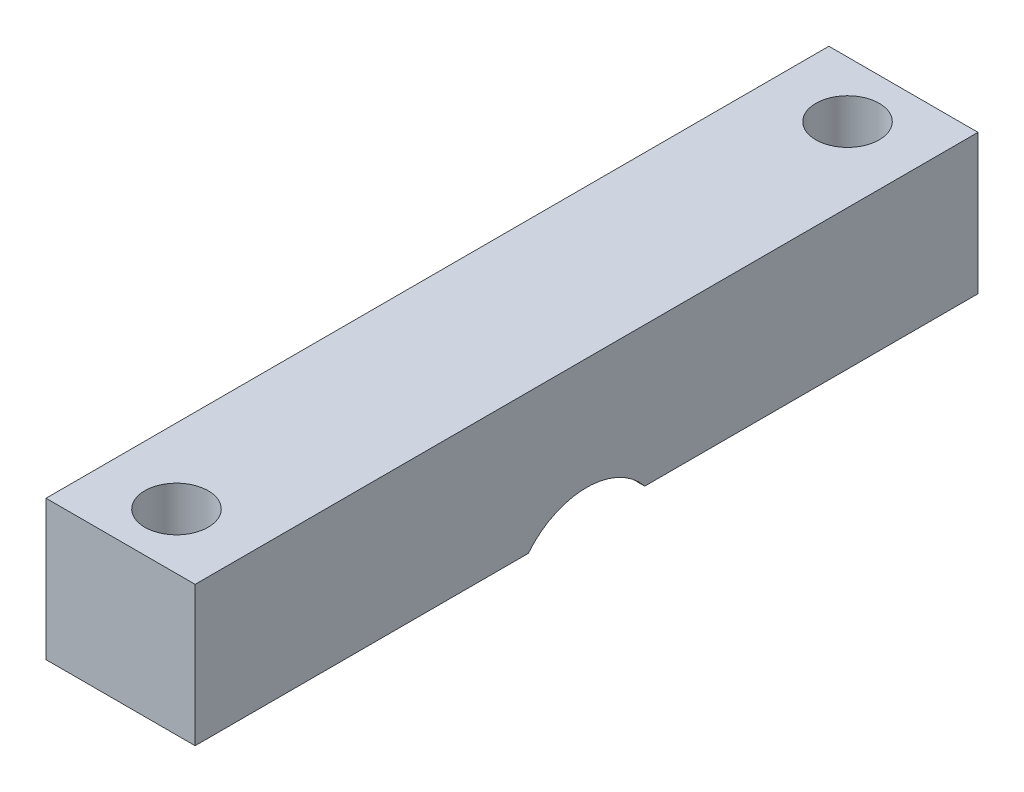
ISO-10303-21;
HEADER;
FILE_DESCRIPTION(('STEP AP214'),'2;1');
FILE_NAME('part.step','',(''),(''),'','','');
FILE_SCHEMA(('AUTOMOTIVE_DESIGN { 1 0 10303 214 1 1 1 1 }'));
ENDSEC;
DATA;
#1=APPLICATION_CONTEXT('core data for automotive mechanical design processes');
#2=APPLICATION_PROTOCOL_DEFINITION('international standard','automotive_design',2000,#1);
#3=PRODUCT_CONTEXT('',#1,'mechanical');
#4=PRODUCT('Part','Part','',(#3));
#5=PRODUCT_RELATED_PRODUCT_CATEGORY('part','',(#4));
#6=PRODUCT_DEFINITION_FORMATION('','',#4);
#7=PRODUCT_DEFINITION_CONTEXT('part definition',#1,'design');
#8=PRODUCT_DEFINITION('design','',#6,#7);
#9=PRODUCT_DEFINITION_SHAPE('','',#8);
#10=(LENGTH_UNIT() NAMED_UNIT(*) SI_UNIT(.MILLI.,.METRE.));
#11=(NAMED_UNIT(*) PLANE_ANGLE_UNIT() SI_UNIT($,.RADIAN.));
#12=(NAMED_UNIT(*) SI_UNIT($,.STERADIAN.) SOLID_ANGLE_UNIT());
#13=UNCERTAINTY_MEASURE_WITH_UNIT(LENGTH_MEASURE(1.E-05),#10,'distance_accuracy_value','');
#14=(GEOMETRIC_REPRESENTATION_CONTEXT(3) GLOBAL_UNCERTAINTY_ASSIGNED_CONTEXT((#13)) GLOBAL_UNIT_ASSIGNED_CONTEXT((#10,
#11,#12)) REPRESENTATION_CONTEXT('',''));
#15=CARTESIAN_POINT('',(0.,0.,0.));
#16=DIRECTION('',(0.,0.,1.));
#17=DIRECTION('',(1.,0.,0.));
#18=AXIS2_PLACEMENT_3D('',#15,#16,#17);
#19=CARTESIAN_POINT('',(44.45,12.7,0.));
#20=DIRECTION('',(1.,0.,0.));
#21=DIRECTION('',(0.,0.,-1.));
#22=AXIS2_PLACEMENT_3D('',#19,#20,#21);
#23=PLANE('',#22);
#24=DIRECTION('',(0.,0.,1.));
#25=VECTOR('',#24,1.);
#26=CARTESIAN_POINT('',(44.45,3.175,0.));
#27=LINE('',#26,#25);
#28=CARTESIAN_POINT('',(44.45,3.175,-259.08));
#29=VERTEX_POINT('',#28);
#30=CARTESIAN_POINT('',(44.45,3.17499999999999,-236.375573728983));
#31=VERTEX_POINT('',#30);
#32=EDGE_CURVE('E62',#29,#31,#27,.T.);
#33=ORIENTED_EDGE('',*,*,#32,.F.);
#34=DIRECTION('',(0.,-1.,0.));
#35=VECTOR('',#34,1.);
#36=CARTESIAN_POINT('',(44.45,12.7,-259.08));
#37=LINE('',#36,#35);
#38=CARTESIAN_POINT('',(44.45,12.7,-259.08));
#39=VERTEX_POINT('',#38);
#40=EDGE_CURVE('E110',#39,#29,#37,.T.);
#41=ORIENTED_EDGE('',*,*,#40,.F.);
#42=DIRECTION('',(0.,0.,1.));
#43=VECTOR('',#42,1.);
#44=CARTESIAN_POINT('',(44.45,12.7,0.));
#45=LINE('',#44,#43);
#46=CARTESIAN_POINT('',(44.45,12.7,-205.74));
#47=VERTEX_POINT('',#46);
#48=EDGE_CURVE('E134',#39,#47,#45,.T.);
#49=ORIENTED_EDGE('',*,*,#48,.T.);
#50=DIRECTION('',(0.,-1.,0.));
#51=VECTOR('',#50,1.);
#52=CARTESIAN_POINT('',(44.45,12.7,-205.74));
#53=LINE('',#52,#51);
#54=CARTESIAN_POINT('',(44.45,3.175,-205.74));
#55=VERTEX_POINT('',#54);
#56=EDGE_CURVE('E117',#47,#55,#53,.T.);
#57=ORIENTED_EDGE('',*,*,#56,.T.);
#58=CARTESIAN_POINT('',(44.45,3.175,-228.444426271017));
#59=VERTEX_POINT('',#58);
#60=EDGE_CURVE('E104',#59,#55,#27,.T.);
#61=ORIENTED_EDGE('',*,*,#60,.F.);
#62=CARTESIAN_POINT('',(44.45,0.,-232.41));
#63=DIRECTION('',(1.,0.,0.));
#64=DIRECTION('',(0.,0.,-1.));
#65=AXIS2_PLACEMENT_3D('',#62,#63,#64);
#66=CIRCLE('',#65,5.07999999999999);
#67=EDGE_CURVE('E114',#31,#59,#66,.T.);
#68=ORIENTED_EDGE('',*,*,#67,.F.);
#69=EDGE_LOOP('',(#33,#41,#49,#57,#61,#68));
#70=FACE_BOUND('',#69,.T.);
#71=ADVANCED_FACE('F41',(#70),#23,.T.);
#72=CARTESIAN_POINT('',(0.,12.7,-259.08));
#73=DIRECTION('',(0.,0.,-1.));
#74=DIRECTION('',(-1.,0.,0.));
#75=AXIS2_PLACEMENT_3D('',#72,#73,#74);
#76=PLANE('',#75);
#77=DIRECTION('',(1.,0.,0.));
#78=VECTOR('',#77,1.);
#79=CARTESIAN_POINT('',(0.,3.175,-259.08));
#80=LINE('',#79,#78);
#81=CARTESIAN_POINT('',(34.29,3.175,-259.08));
#82=VERTEX_POINT('',#81);
#83=EDGE_CURVE('E162',#82,#29,#80,.T.);
#84=ORIENTED_EDGE('',*,*,#83,.F.);
#85=DIRECTION('',(0.,-1.,0.));
#86=VECTOR('',#85,1.);
#87=CARTESIAN_POINT('',(34.29,12.7,-259.08));
#88=LINE('',#87,#86);
#89=CARTESIAN_POINT('',(34.29,12.7,-259.08));
#90=VERTEX_POINT('',#89);
#91=EDGE_CURVE('E155',#90,#82,#88,.T.);
#92=ORIENTED_EDGE('',*,*,#91,.F.);
#93=DIRECTION('',(1.,0.,0.));
#94=VECTOR('',#93,1.);
#95=CARTESIAN_POINT('',(0.,12.7,-259.08));
#96=LINE('',#95,#94);
#97=EDGE_CURVE('E138',#90,#39,#96,.T.);
#98=ORIENTED_EDGE('',*,*,#97,.T.);
#99=ORIENTED_EDGE('',*,*,#40,.T.);
#100=EDGE_LOOP('',(#84,#92,#98,#99));
#101=FACE_BOUND('',#100,.T.);
#102=ADVANCED_FACE('F161',(#101),#76,.T.);
#103=CARTESIAN_POINT('',(34.29,12.7,0.));
#104=DIRECTION('',(1.,0.,0.));
#105=DIRECTION('',(0.,0.,-1.));
#106=AXIS2_PLACEMENT_3D('',#103,#104,#105);
#107=PLANE('',#106);
#108=ORIENTED_EDGE('',*,*,#91,.T.);
#109=DIRECTION('',(0.,0.,1.));
#110=VECTOR('',#109,1.);
#111=CARTESIAN_POINT('',(34.29,3.175,0.));
#112=LINE('',#111,#110);
#113=CARTESIAN_POINT('',(34.29,3.175,-242.941826764622));
#114=VERTEX_POINT('',#113);
#115=EDGE_CURVE('E179',#82,#114,#112,.T.);
#116=ORIENTED_EDGE('',*,*,#115,.T.);
#117=CARTESIAN_POINT('',(34.29,0.,-232.41));
#118=DIRECTION('',(1.,0.,0.));
#119=DIRECTION('',(0.,0.,-1.));
#120=AXIS2_PLACEMENT_3D('',#117,#118,#119);
#121=CIRCLE('',#120,11.);
#122=CARTESIAN_POINT('',(34.29,3.175,-221.878173235378));
#123=VERTEX_POINT('',#122);
#124=EDGE_CURVE('E124',#114,#123,#121,.T.);
#125=ORIENTED_EDGE('',*,*,#124,.T.);
#126=CARTESIAN_POINT('',(34.29,3.175,-205.74));
#127=VERTEX_POINT('',#126);
#128=EDGE_CURVE('E175',#123,#127,#112,.T.);
#129=ORIENTED_EDGE('',*,*,#128,.T.);
#130=DIRECTION('',(0.,-1.,0.));
#131=VECTOR('',#130,1.);
#132=CARTESIAN_POINT('',(34.29,12.7,-205.74));
#133=LINE('',#132,#131);
#134=CARTESIAN_POINT('',(34.29,12.7,-205.74));
#135=VERTEX_POINT('',#134);
#136=EDGE_CURVE('E152',#135,#127,#133,.T.);
#137=ORIENTED_EDGE('',*,*,#136,.F.);
#138=DIRECTION('',(0.,0.,1.));
#139=VECTOR('',#138,1.);
#140=CARTESIAN_POINT('',(34.29,12.7,0.));
#141=LINE('',#140,#139);
#142=EDGE_CURVE('E141',#90,#135,#141,.T.);
#143=ORIENTED_EDGE('',*,*,#142,.F.);
#144=EDGE_LOOP('',(#108,#116,#125,#129,#137,#143));
#145=FACE_BOUND('',#144,.T.);
#146=ADVANCED_FACE('F203',(#145),#107,.F.);
#147=CARTESIAN_POINT('',(39.37,12.7,-255.27));
#148=DIRECTION('',(0.,-1.,0.));
#149=DIRECTION('',(0.,0.,-1.));
#150=AXIS2_PLACEMENT_3D('',#147,#148,#149);
#151=CYLINDRICAL_SURFACE('',#150,2.159);
#152=CARTESIAN_POINT('',(39.37,3.175,-255.27));
#153=DIRECTION('',(0.,1.,0.));
#154=DIRECTION('',(0.,0.,1.));
#155=AXIS2_PLACEMENT_3D('',#152,#153,#154);
#156=CIRCLE('',#155,2.159);
#157=CARTESIAN_POINT('',(39.37,3.175,-253.111));
#158=VERTEX_POINT('',#157);
#159=EDGE_CURVE('E122',#158,#158,#156,.T.);
#160=ORIENTED_EDGE('',*,*,#159,.F.);
#161=EDGE_LOOP('',(#160));
#162=FACE_BOUND('',#161,.T.);
#163=CARTESIAN_POINT('',(39.37,12.7,-255.27));
#164=DIRECTION('',(0.,1.,0.));
#165=DIRECTION('',(0.,0.,1.));
#166=AXIS2_PLACEMENT_3D('',#163,#164,#165);
#167=CIRCLE('',#166,2.159);
#168=CARTESIAN_POINT('',(39.37,12.7,-253.111));
#169=VERTEX_POINT('',#168);
#170=EDGE_CURVE('E145',#169,#169,#167,.T.);
#171=ORIENTED_EDGE('',*,*,#170,.T.);
#172=EDGE_LOOP('',(#171));
#173=FACE_BOUND('',#172,.T.);
#174=ADVANCED_FACE('F207',(#162,#173),#151,.F.);
#175=CARTESIAN_POINT('',(0.,12.7,-205.74));
#176=DIRECTION('',(0.,0.,-1.));
#177=DIRECTION('',(-1.,0.,0.));
#178=AXIS2_PLACEMENT_3D('',#175,#176,#177);
#179=PLANE('',#178);
#180=ORIENTED_EDGE('',*,*,#136,.T.);
#181=DIRECTION('',(1.,0.,0.));
#182=VECTOR('',#181,1.);
#183=CARTESIAN_POINT('',(0.,3.175,-205.74));
#184=LINE('',#183,#182);
#185=EDGE_CURVE('E173',#127,#55,#184,.T.);
#186=ORIENTED_EDGE('',*,*,#185,.T.);
#187=ORIENTED_EDGE('',*,*,#56,.F.);
#188=DIRECTION('',(1.,0.,0.));
#189=VECTOR('',#188,1.);
#190=CARTESIAN_POINT('',(0.,12.7,-205.74));
#191=LINE('',#190,#189);
#192=EDGE_CURVE('E143',#135,#47,#191,.T.);
#193=ORIENTED_EDGE('',*,*,#192,.F.);
#194=EDGE_LOOP('',(#180,#186,#187,#193));
#195=FACE_BOUND('',#194,.T.);
#196=ADVANCED_FACE('F172',(#195),#179,.F.);
#197=CARTESIAN_POINT('',(39.37,12.7,-209.55));
#198=DIRECTION('',(0.,-1.,0.));
#199=DIRECTION('',(0.,0.,-1.));
#200=AXIS2_PLACEMENT_3D('',#197,#198,#199);
#201=CYLINDRICAL_SURFACE('',#200,2.15899999999999);
#202=CARTESIAN_POINT('',(39.37,3.175,-209.55));
#203=DIRECTION('',(0.,1.,0.));
#204=DIRECTION('',(0.,0.,1.));
#205=AXIS2_PLACEMENT_3D('',#202,#203,#204);
#206=CIRCLE('',#205,2.15899999999999);
#207=CARTESIAN_POINT('',(39.37,3.175,-207.391));
#208=VERTEX_POINT('',#207);
#209=EDGE_CURVE('E127',#208,#208,#206,.F.);
#210=ORIENTED_EDGE('',*,*,#209,.T.);
#211=EDGE_LOOP('',(#210));
#212=FACE_BOUND('',#211,.T.);
#213=CARTESIAN_POINT('',(39.37,12.7,-209.55));
#214=DIRECTION('',(0.,1.,0.));
#215=DIRECTION('',(0.,0.,1.));
#216=AXIS2_PLACEMENT_3D('',#213,#214,#215);
#217=CIRCLE('',#216,2.15899999999999);
#218=CARTESIAN_POINT('',(39.37,12.7,-207.391));
#219=VERTEX_POINT('',#218);
#220=EDGE_CURVE('E148',#219,#219,#217,.F.);
#221=ORIENTED_EDGE('',*,*,#220,.F.);
#222=EDGE_LOOP('',(#221));
#223=FACE_BOUND('',#222,.T.);
#224=ADVANCED_FACE('F187',(#212,#223),#201,.F.);
#225=CARTESIAN_POINT('',(0.,12.7,0.));
#226=DIRECTION('',(0.,1.,0.));
#227=DIRECTION('',(0.,0.,1.));
#228=AXIS2_PLACEMENT_3D('',#225,#226,#227);
#229=PLANE('',#228);
#230=ORIENTED_EDGE('',*,*,#48,.F.);
#231=ORIENTED_EDGE('',*,*,#97,.F.);
#232=ORIENTED_EDGE('',*,*,#142,.T.);
#233=ORIENTED_EDGE('',*,*,#192,.T.);
#234=EDGE_LOOP('',(#230,#231,#232,#233));
#235=FACE_BOUND('',#234,.T.);
#236=ORIENTED_EDGE('',*,*,#170,.F.);
#237=EDGE_LOOP('',(#236));
#238=FACE_BOUND('',#237,.T.);
#239=ORIENTED_EDGE('',*,*,#220,.T.);
#240=EDGE_LOOP('',(#239));
#241=FACE_BOUND('',#240,.T.);
#242=ADVANCED_FACE('F166',(#235,#238,#241),#229,.T.);
#243=CARTESIAN_POINT('',(41.29,0.,-232.41));
#244=DIRECTION('',(1.,0.,0.));
#245=DIRECTION('',(0.,0.,-1.));
#246=AXIS2_PLACEMENT_3D('',#243,#244,#245);
#247=PLANE('',#246);
#248=CARTESIAN_POINT('',(41.29,0.,-232.41));
#249=DIRECTION('',(1.,0.,0.));
#250=DIRECTION('',(0.,0.,-1.));
#251=AXIS2_PLACEMENT_3D('',#248,#249,#250);
#252=CIRCLE('',#251,11.);
#253=CARTESIAN_POINT('',(41.29,3.175,-242.941826764622));
#254=VERTEX_POINT('',#253);
#255=CARTESIAN_POINT('',(41.29,3.175,-221.878173235378));
#256=VERTEX_POINT('',#255);
#257=EDGE_CURVE('E131',#254,#256,#252,.T.);
#258=ORIENTED_EDGE('',*,*,#257,.F.);
#259=DIRECTION('',(0.,0.,1.));
#260=VECTOR('',#259,1.);
#261=CARTESIAN_POINT('',(41.29,3.175,-232.41));
#262=LINE('',#261,#260);
#263=CARTESIAN_POINT('',(41.29,3.175,-236.375573728983));
#264=VERTEX_POINT('',#263);
#265=EDGE_CURVE('E177',#254,#264,#262,.T.);
#266=ORIENTED_EDGE('',*,*,#265,.T.);
#267=CARTESIAN_POINT('',(41.29,0.,-232.41));
#268=DIRECTION('',(1.,0.,0.));
#269=DIRECTION('',(0.,0.,-1.));
#270=AXIS2_PLACEMENT_3D('',#267,#268,#269);
#271=CIRCLE('',#270,5.07999999999999);
#272=CARTESIAN_POINT('',(41.29,3.17499999999999,-228.444426271017));
#273=VERTEX_POINT('',#272);
#274=EDGE_CURVE('E121',#273,#264,#271,.F.);
#275=ORIENTED_EDGE('',*,*,#274,.F.);
#276=EDGE_CURVE('E55',#273,#256,#262,.T.);
#277=ORIENTED_EDGE('',*,*,#276,.T.);
#278=EDGE_LOOP('',(#258,#266,#275,#277));
#279=FACE_BOUND('',#278,.T.);
#280=ADVANCED_FACE('F220',(#279),#247,.F.);
#281=CARTESIAN_POINT('',(41.29,0.,-232.41));
#282=DIRECTION('',(-1.,0.,0.));
#283=DIRECTION('',(0.,0.,1.));
#284=AXIS2_PLACEMENT_3D('',#281,#282,#283);
#285=CYLINDRICAL_SURFACE('',#284,11.);
#286=DIRECTION('',(-1.,0.,0.));
#287=VECTOR('',#286,1.);
#288=CARTESIAN_POINT('',(41.29,3.175,-242.941826764622));
#289=LINE('',#288,#287);
#290=EDGE_CURVE('E182',#254,#114,#289,.T.);
#291=ORIENTED_EDGE('',*,*,#290,.F.);
#292=ORIENTED_EDGE('',*,*,#257,.T.);
#293=DIRECTION('',(-1.,0.,0.));
#294=VECTOR('',#293,1.);
#295=CARTESIAN_POINT('',(41.29,3.175,-221.878173235378));
#296=LINE('',#295,#294);
#297=EDGE_CURVE('E118',#123,#256,#296,.F.);
#298=ORIENTED_EDGE('',*,*,#297,.F.);
#299=ORIENTED_EDGE('',*,*,#124,.F.);
#300=EDGE_LOOP('',(#291,#292,#298,#299));
#301=FACE_BOUND('',#300,.T.);
#302=ADVANCED_FACE('F197',(#301),#285,.F.);
#303=CARTESIAN_POINT('',(34.29,0.,-232.41));
#304=DIRECTION('',(-1.,0.,0.));
#305=DIRECTION('',(0.,0.,1.));
#306=AXIS2_PLACEMENT_3D('',#303,#304,#305);
#307=CYLINDRICAL_SURFACE('',#306,5.07999999999999);
#308=DIRECTION('',(-1.,0.,0.));
#309=VECTOR('',#308,1.);
#310=CARTESIAN_POINT('',(34.29,3.175,-236.375573728983));
#311=LINE('',#310,#309);
#312=EDGE_CURVE('E11',#31,#264,#311,.T.);
#313=ORIENTED_EDGE('',*,*,#312,.F.);
#314=ORIENTED_EDGE('',*,*,#67,.T.);
#315=DIRECTION('',(-1.,0.,0.));
#316=VECTOR('',#315,1.);
#317=CARTESIAN_POINT('',(34.29,3.175,-228.444426271017));
#318=LINE('',#317,#316);
#319=EDGE_CURVE('E48',#273,#59,#318,.F.);
#320=ORIENTED_EDGE('',*,*,#319,.F.);
#321=ORIENTED_EDGE('',*,*,#274,.T.);
#322=EDGE_LOOP('',(#313,#314,#320,#321));
#323=FACE_BOUND('',#322,.T.);
#324=ADVANCED_FACE('F120',(#323),#307,.F.);
#325=CARTESIAN_POINT('',(0.,3.175,0.));
#326=DIRECTION('',(0.,1.,0.));
#327=DIRECTION('',(0.,0.,1.));
#328=AXIS2_PLACEMENT_3D('',#325,#326,#327);
#329=PLANE('',#328);
#330=ORIENTED_EDGE('',*,*,#297,.T.);
#331=ORIENTED_EDGE('',*,*,#276,.F.);
#332=ORIENTED_EDGE('',*,*,#319,.T.);
#333=ORIENTED_EDGE('',*,*,#60,.T.);
#334=ORIENTED_EDGE('',*,*,#185,.F.);
#335=ORIENTED_EDGE('',*,*,#128,.F.);
#336=EDGE_LOOP('',(#330,#331,#332,#333,#334,#335));
#337=FACE_BOUND('',#336,.T.);
#338=ORIENTED_EDGE('',*,*,#209,.F.);
#339=EDGE_LOOP('',(#338));
#340=FACE_BOUND('',#339,.T.);
#341=ADVANCED_FACE('F102',(#337,#340),#329,.F.);
#342=ORIENTED_EDGE('',*,*,#159,.T.);
#343=EDGE_LOOP('',(#342));
#344=FACE_BOUND('',#343,.T.);
#345=ORIENTED_EDGE('',*,*,#83,.T.);
#346=ORIENTED_EDGE('',*,*,#32,.T.);
#347=ORIENTED_EDGE('',*,*,#312,.T.);
#348=ORIENTED_EDGE('',*,*,#265,.F.);
#349=ORIENTED_EDGE('',*,*,#290,.T.);
#350=ORIENTED_EDGE('',*,*,#115,.F.);
#351=EDGE_LOOP('',(#345,#346,#347,#348,#349,#350));
#352=FACE_BOUND('',#351,.T.);
#353=ADVANCED_FACE('F190',(#344,#352),#329,.F.);
#354=CLOSED_SHELL('',(#71,#102,#146,#174,#196,#224,#242,#280,#302,#324,#341,#353));
#355=MANIFOLD_SOLID_BREP('B2',#354);
#356=ADVANCED_BREP_SHAPE_REPRESENTATION('',(#18,#355),#14);
#357=SHAPE_DEFINITION_REPRESENTATION(#9,#356);
ENDSEC;
END-ISO-10303-21;
